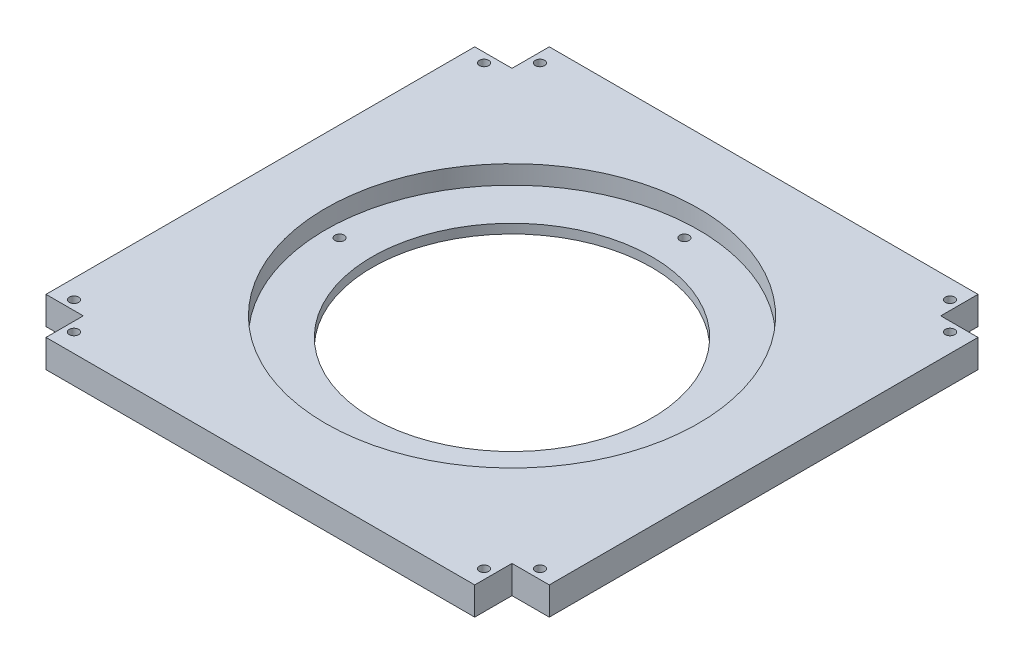
ISO-10303-21;
HEADER;
FILE_DESCRIPTION(('STEP AP214'),'2;1');
FILE_NAME('part.step','',(''),(''),'','','');
FILE_SCHEMA(('AUTOMOTIVE_DESIGN { 1 0 10303 214 1 1 1 1 }'));
ENDSEC;
DATA;
#1=APPLICATION_CONTEXT('core data for automotive mechanical design processes');
#2=APPLICATION_PROTOCOL_DEFINITION('international standard','automotive_design',2000,#1);
#3=PRODUCT_CONTEXT('',#1,'mechanical');
#4=PRODUCT('Part','Part','',(#3));
#5=PRODUCT_RELATED_PRODUCT_CATEGORY('part','',(#4));
#6=PRODUCT_DEFINITION_FORMATION('','',#4);
#7=PRODUCT_DEFINITION_CONTEXT('part definition',#1,'design');
#8=PRODUCT_DEFINITION('design','',#6,#7);
#9=PRODUCT_DEFINITION_SHAPE('','',#8);
#10=(LENGTH_UNIT() NAMED_UNIT(*) SI_UNIT(.MILLI.,.METRE.));
#11=(NAMED_UNIT(*) PLANE_ANGLE_UNIT() SI_UNIT($,.RADIAN.));
#12=(NAMED_UNIT(*) SI_UNIT($,.STERADIAN.) SOLID_ANGLE_UNIT());
#13=UNCERTAINTY_MEASURE_WITH_UNIT(LENGTH_MEASURE(1.E-05),#10,'distance_accuracy_value','');
#14=(GEOMETRIC_REPRESENTATION_CONTEXT(3) GLOBAL_UNCERTAINTY_ASSIGNED_CONTEXT((#13)) GLOBAL_UNIT_ASSIGNED_CONTEXT((#10,
#11,#12)) REPRESENTATION_CONTEXT('',''));
#15=CARTESIAN_POINT('',(0.,0.,0.));
#16=DIRECTION('',(0.,0.,1.));
#17=DIRECTION('',(1.,0.,0.));
#18=AXIS2_PLACEMENT_3D('',#15,#16,#17);
#19=CARTESIAN_POINT('',(0.,15.,0.));
#20=DIRECTION('',(1.,0.,0.));
#21=DIRECTION('',(0.,0.,-1.));
#22=AXIS2_PLACEMENT_3D('',#19,#20,#21);
#23=PLANE('',#22);
#24=DIRECTION('',(0.,0.,1.));
#25=VECTOR('',#24,1.);
#26=CARTESIAN_POINT('',(0.,0.,0.));
#27=LINE('',#26,#25);
#28=CARTESIAN_POINT('',(0.,0.,-250.));
#29=VERTEX_POINT('',#28);
#30=CARTESIAN_POINT('',(0.,0.,-20.));
#31=VERTEX_POINT('',#30);
#32=EDGE_CURVE('E158',#29,#31,#27,.T.);
#33=ORIENTED_EDGE('',*,*,#32,.T.);
#34=DIRECTION('',(0.,1.,0.));
#35=VECTOR('',#34,1.);
#36=CARTESIAN_POINT('',(0.,0.,-20.));
#37=LINE('',#36,#35);
#38=CARTESIAN_POINT('',(0.,15.,-20.));
#39=VERTEX_POINT('',#38);
#40=EDGE_CURVE('E186',#31,#39,#37,.T.);
#41=ORIENTED_EDGE('',*,*,#40,.T.);
#42=DIRECTION('',(0.,0.,1.));
#43=VECTOR('',#42,1.);
#44=CARTESIAN_POINT('',(0.,15.,0.));
#45=LINE('',#44,#43);
#46=CARTESIAN_POINT('',(0.,15.,-250.));
#47=VERTEX_POINT('',#46);
#48=EDGE_CURVE('E146',#47,#39,#45,.T.);
#49=ORIENTED_EDGE('',*,*,#48,.F.);
#50=DIRECTION('',(0.,1.,0.));
#51=VECTOR('',#50,1.);
#52=CARTESIAN_POINT('',(0.,0.,-250.));
#53=LINE('',#52,#51);
#54=EDGE_CURVE('E168',#29,#47,#53,.T.);
#55=ORIENTED_EDGE('',*,*,#54,.F.);
#56=EDGE_LOOP('',(#33,#41,#49,#55));
#57=FACE_BOUND('',#56,.T.);
#58=ADVANCED_FACE('F33',(#57),#23,.F.);
#59=CARTESIAN_POINT('',(0.,15.,0.));
#60=DIRECTION('',(0.,0.,-1.));
#61=DIRECTION('',(-1.,0.,0.));
#62=AXIS2_PLACEMENT_3D('',#59,#60,#61);
#63=PLANE('',#62);
#64=DIRECTION('',(1.,0.,0.));
#65=VECTOR('',#64,1.);
#66=CARTESIAN_POINT('',(0.,15.,0.));
#67=LINE('',#66,#65);
#68=CARTESIAN_POINT('',(20.,15.,0.));
#69=VERTEX_POINT('',#68);
#70=CARTESIAN_POINT('',(250.,15.,0.));
#71=VERTEX_POINT('',#70);
#72=EDGE_CURVE('E149',#69,#71,#67,.T.);
#73=ORIENTED_EDGE('',*,*,#72,.F.);
#74=DIRECTION('',(0.,1.,0.));
#75=VECTOR('',#74,1.);
#76=CARTESIAN_POINT('',(20.,0.,0.));
#77=LINE('',#76,#75);
#78=CARTESIAN_POINT('',(20.,0.,0.));
#79=VERTEX_POINT('',#78);
#80=EDGE_CURVE('E182',#79,#69,#77,.T.);
#81=ORIENTED_EDGE('',*,*,#80,.F.);
#82=DIRECTION('',(1.,0.,0.));
#83=VECTOR('',#82,1.);
#84=CARTESIAN_POINT('',(0.,0.,0.));
#85=LINE('',#84,#83);
#86=CARTESIAN_POINT('',(250.,0.,0.));
#87=VERTEX_POINT('',#86);
#88=EDGE_CURVE('E152',#79,#87,#85,.T.);
#89=ORIENTED_EDGE('',*,*,#88,.T.);
#90=DIRECTION('',(0.,1.,0.));
#91=VECTOR('',#90,1.);
#92=CARTESIAN_POINT('',(250.,0.,0.));
#93=LINE('',#92,#91);
#94=EDGE_CURVE('E204',#87,#71,#93,.T.);
#95=ORIENTED_EDGE('',*,*,#94,.T.);
#96=EDGE_LOOP('',(#73,#81,#89,#95));
#97=FACE_BOUND('',#96,.T.);
#98=ADVANCED_FACE('F366',(#97),#63,.F.);
#99=CARTESIAN_POINT('',(270.,15.,0.));
#100=DIRECTION('',(-1.,0.,0.));
#101=DIRECTION('',(0.,0.,1.));
#102=AXIS2_PLACEMENT_3D('',#99,#100,#101);
#103=PLANE('',#102);
#104=DIRECTION('',(0.,0.,-1.));
#105=VECTOR('',#104,1.);
#106=CARTESIAN_POINT('',(270.,15.,0.));
#107=LINE('',#106,#105);
#108=CARTESIAN_POINT('',(270.,15.,-20.));
#109=VERTEX_POINT('',#108);
#110=CARTESIAN_POINT('',(270.,15.,-250.));
#111=VERTEX_POINT('',#110);
#112=EDGE_CURVE('E41',#109,#111,#107,.T.);
#113=ORIENTED_EDGE('',*,*,#112,.F.);
#114=DIRECTION('',(0.,1.,0.));
#115=VECTOR('',#114,1.);
#116=CARTESIAN_POINT('',(270.,0.,-20.));
#117=LINE('',#116,#115);
#118=CARTESIAN_POINT('',(270.,0.,-20.));
#119=VERTEX_POINT('',#118);
#120=EDGE_CURVE('E200',#119,#109,#117,.T.);
#121=ORIENTED_EDGE('',*,*,#120,.F.);
#122=DIRECTION('',(0.,0.,-1.));
#123=VECTOR('',#122,1.);
#124=CARTESIAN_POINT('',(270.,0.,0.));
#125=LINE('',#124,#123);
#126=CARTESIAN_POINT('',(270.,0.,-250.));
#127=VERTEX_POINT('',#126);
#128=EDGE_CURVE('E147',#119,#127,#125,.T.);
#129=ORIENTED_EDGE('',*,*,#128,.T.);
#130=DIRECTION('',(0.,1.,0.));
#131=VECTOR('',#130,1.);
#132=CARTESIAN_POINT('',(270.,0.,-250.));
#133=LINE('',#132,#131);
#134=EDGE_CURVE('E179',#127,#111,#133,.T.);
#135=ORIENTED_EDGE('',*,*,#134,.T.);
#136=EDGE_LOOP('',(#113,#121,#129,#135));
#137=FACE_BOUND('',#136,.T.);
#138=ADVANCED_FACE('F373',(#137),#103,.F.);
#139=CARTESIAN_POINT('',(0.,15.,-270.));
#140=DIRECTION('',(0.,0.,1.));
#141=DIRECTION('',(1.,0.,0.));
#142=AXIS2_PLACEMENT_3D('',#139,#140,#141);
#143=PLANE('',#142);
#144=DIRECTION('',(-1.,0.,0.));
#145=VECTOR('',#144,1.);
#146=CARTESIAN_POINT('',(0.,15.,-270.));
#147=LINE('',#146,#145);
#148=CARTESIAN_POINT('',(250.,15.,-270.));
#149=VERTEX_POINT('',#148);
#150=CARTESIAN_POINT('',(20.,15.,-270.));
#151=VERTEX_POINT('',#150);
#152=EDGE_CURVE('E11',#149,#151,#147,.T.);
#153=ORIENTED_EDGE('',*,*,#152,.F.);
#154=DIRECTION('',(0.,1.,0.));
#155=VECTOR('',#154,1.);
#156=CARTESIAN_POINT('',(250.,0.,-270.));
#157=LINE('',#156,#155);
#158=CARTESIAN_POINT('',(250.,0.,-270.));
#159=VERTEX_POINT('',#158);
#160=EDGE_CURVE('E127',#159,#149,#157,.T.);
#161=ORIENTED_EDGE('',*,*,#160,.F.);
#162=DIRECTION('',(-1.,0.,0.));
#163=VECTOR('',#162,1.);
#164=CARTESIAN_POINT('',(0.,0.,-270.));
#165=LINE('',#164,#163);
#166=CARTESIAN_POINT('',(20.,0.,-270.));
#167=VERTEX_POINT('',#166);
#168=EDGE_CURVE('E36',#159,#167,#165,.T.);
#169=ORIENTED_EDGE('',*,*,#168,.T.);
#170=DIRECTION('',(0.,1.,0.));
#171=VECTOR('',#170,1.);
#172=CARTESIAN_POINT('',(20.,0.,-270.));
#173=LINE('',#172,#171);
#174=EDGE_CURVE('E162',#167,#151,#173,.T.);
#175=ORIENTED_EDGE('',*,*,#174,.T.);
#176=EDGE_LOOP('',(#153,#161,#169,#175));
#177=FACE_BOUND('',#176,.T.);
#178=ADVANCED_FACE('F139',(#177),#143,.F.);
#179=CARTESIAN_POINT('',(0.,15.,0.));
#180=DIRECTION('',(0.,-1.,0.));
#181=DIRECTION('',(0.,0.,-1.));
#182=AXIS2_PLACEMENT_3D('',#179,#180,#181);
#183=PLANE('',#182);
#184=CARTESIAN_POINT('',(135.,15.,-135.));
#185=DIRECTION('',(0.,1.,0.));
#186=DIRECTION('',(0.,0.,1.));
#187=AXIS2_PLACEMENT_3D('',#184,#185,#186);
#188=CIRCLE('',#187,100.);
#189=CARTESIAN_POINT('',(135.,15.,-35.));
#190=VERTEX_POINT('',#189);
#191=EDGE_CURVE('E269',#190,#190,#188,.T.);
#192=ORIENTED_EDGE('',*,*,#191,.F.);
#193=EDGE_LOOP('',(#192));
#194=FACE_BOUND('',#193,.T.);
#195=CARTESIAN_POINT('',(25.,15.,-260.));
#196=DIRECTION('',(0.,1.,0.));
#197=DIRECTION('',(0.,0.,1.));
#198=AXIS2_PLACEMENT_3D('',#195,#196,#197);
#199=CIRCLE('',#198,2.5);
#200=CARTESIAN_POINT('',(25.,15.,-257.5));
#201=VERTEX_POINT('',#200);
#202=EDGE_CURVE('E227',#201,#201,#199,.T.);
#203=ORIENTED_EDGE('',*,*,#202,.F.);
#204=EDGE_LOOP('',(#203));
#205=FACE_BOUND('',#204,.T.);
#206=CARTESIAN_POINT('',(245.,15.,-260.));
#207=DIRECTION('',(0.,1.,0.));
#208=DIRECTION('',(0.,0.,1.));
#209=AXIS2_PLACEMENT_3D('',#206,#207,#208);
#210=CIRCLE('',#209,2.5);
#211=CARTESIAN_POINT('',(245.,15.,-257.5));
#212=VERTEX_POINT('',#211);
#213=EDGE_CURVE('E234',#212,#212,#210,.T.);
#214=ORIENTED_EDGE('',*,*,#213,.F.);
#215=EDGE_LOOP('',(#214));
#216=FACE_BOUND('',#215,.T.);
#217=CARTESIAN_POINT('',(260.,15.,-245.));
#218=DIRECTION('',(0.,1.,0.));
#219=DIRECTION('',(0.,0.,1.));
#220=AXIS2_PLACEMENT_3D('',#217,#218,#219);
#221=CIRCLE('',#220,2.50000000000002);
#222=CARTESIAN_POINT('',(260.,15.,-242.5));
#223=VERTEX_POINT('',#222);
#224=EDGE_CURVE('E240',#223,#223,#221,.T.);
#225=ORIENTED_EDGE('',*,*,#224,.F.);
#226=EDGE_LOOP('',(#225));
#227=FACE_BOUND('',#226,.T.);
#228=CARTESIAN_POINT('',(260.,15.,-25.));
#229=DIRECTION('',(0.,1.,0.));
#230=DIRECTION('',(0.,0.,1.));
#231=AXIS2_PLACEMENT_3D('',#228,#229,#230);
#232=CIRCLE('',#231,2.50000000000002);
#233=CARTESIAN_POINT('',(260.,15.,-22.5));
#234=VERTEX_POINT('',#233);
#235=EDGE_CURVE('E246',#234,#234,#232,.T.);
#236=ORIENTED_EDGE('',*,*,#235,.F.);
#237=EDGE_LOOP('',(#236));
#238=FACE_BOUND('',#237,.T.);
#239=CARTESIAN_POINT('',(245.,15.,-10.));
#240=DIRECTION('',(0.,1.,0.));
#241=DIRECTION('',(0.,0.,1.));
#242=AXIS2_PLACEMENT_3D('',#239,#240,#241);
#243=CIRCLE('',#242,2.5);
#244=CARTESIAN_POINT('',(245.,15.,-7.5));
#245=VERTEX_POINT('',#244);
#246=EDGE_CURVE('E252',#245,#245,#243,.T.);
#247=ORIENTED_EDGE('',*,*,#246,.F.);
#248=EDGE_LOOP('',(#247));
#249=FACE_BOUND('',#248,.T.);
#250=CARTESIAN_POINT('',(25.,15.,-9.99999999999997));
#251=DIRECTION('',(0.,1.,0.));
#252=DIRECTION('',(0.,0.,1.));
#253=AXIS2_PLACEMENT_3D('',#250,#251,#252);
#254=CIRCLE('',#253,2.5);
#255=CARTESIAN_POINT('',(25.,15.,-7.49999999999997));
#256=VERTEX_POINT('',#255);
#257=EDGE_CURVE('E258',#256,#256,#254,.T.);
#258=ORIENTED_EDGE('',*,*,#257,.F.);
#259=EDGE_LOOP('',(#258));
#260=FACE_BOUND('',#259,.T.);
#261=CARTESIAN_POINT('',(10.,15.,-25.));
#262=DIRECTION('',(0.,1.,0.));
#263=DIRECTION('',(0.,0.,1.));
#264=AXIS2_PLACEMENT_3D('',#261,#262,#263);
#265=CIRCLE('',#264,2.5);
#266=CARTESIAN_POINT('',(10.,15.,-22.5));
#267=VERTEX_POINT('',#266);
#268=EDGE_CURVE('E264',#267,#267,#265,.T.);
#269=ORIENTED_EDGE('',*,*,#268,.F.);
#270=EDGE_LOOP('',(#269));
#271=FACE_BOUND('',#270,.T.);
#272=CARTESIAN_POINT('',(9.99999999999997,15.,-245.));
#273=DIRECTION('',(0.,1.,0.));
#274=DIRECTION('',(0.,0.,1.));
#275=AXIS2_PLACEMENT_3D('',#272,#273,#274);
#276=CIRCLE('',#275,2.5);
#277=CARTESIAN_POINT('',(9.99999999999997,15.,-242.5));
#278=VERTEX_POINT('',#277);
#279=EDGE_CURVE('E221',#278,#278,#276,.T.);
#280=ORIENTED_EDGE('',*,*,#279,.F.);
#281=EDGE_LOOP('',(#280));
#282=FACE_BOUND('',#281,.T.);
#283=ORIENTED_EDGE('',*,*,#48,.T.);
#284=DIRECTION('',(-1.,0.,0.));
#285=VECTOR('',#284,1.);
#286=CARTESIAN_POINT('',(0.,15.,-20.));
#287=LINE('',#286,#285);
#288=CARTESIAN_POINT('',(20.,15.,-20.));
#289=VERTEX_POINT('',#288);
#290=EDGE_CURVE('E190',#289,#39,#287,.T.);
#291=ORIENTED_EDGE('',*,*,#290,.F.);
#292=DIRECTION('',(0.,0.,-1.));
#293=VECTOR('',#292,1.);
#294=CARTESIAN_POINT('',(20.,15.,0.));
#295=LINE('',#294,#293);
#296=EDGE_CURVE('E193',#69,#289,#295,.T.);
#297=ORIENTED_EDGE('',*,*,#296,.F.);
#298=ORIENTED_EDGE('',*,*,#72,.T.);
#299=DIRECTION('',(0.,0.,1.));
#300=VECTOR('',#299,1.);
#301=CARTESIAN_POINT('',(250.,15.,0.));
#302=LINE('',#301,#300);
#303=CARTESIAN_POINT('',(250.,15.,-20.));
#304=VERTEX_POINT('',#303);
#305=EDGE_CURVE('E208',#304,#71,#302,.T.);
#306=ORIENTED_EDGE('',*,*,#305,.F.);
#307=DIRECTION('',(-1.,0.,0.));
#308=VECTOR('',#307,1.);
#309=CARTESIAN_POINT('',(270.,15.,-20.));
#310=LINE('',#309,#308);
#311=EDGE_CURVE('E189',#109,#304,#310,.T.);
#312=ORIENTED_EDGE('',*,*,#311,.F.);
#313=ORIENTED_EDGE('',*,*,#112,.T.);
#314=DIRECTION('',(1.,0.,0.));
#315=VECTOR('',#314,1.);
#316=CARTESIAN_POINT('',(270.,15.,-250.));
#317=LINE('',#316,#315);
#318=CARTESIAN_POINT('',(250.,15.,-250.));
#319=VERTEX_POINT('',#318);
#320=EDGE_CURVE('E134',#319,#111,#317,.T.);
#321=ORIENTED_EDGE('',*,*,#320,.F.);
#322=DIRECTION('',(0.,0.,1.));
#323=VECTOR('',#322,1.);
#324=CARTESIAN_POINT('',(250.,15.,-270.));
#325=LINE('',#324,#323);
#326=EDGE_CURVE('E207',#149,#319,#325,.T.);
#327=ORIENTED_EDGE('',*,*,#326,.F.);
#328=ORIENTED_EDGE('',*,*,#152,.T.);
#329=DIRECTION('',(0.,0.,-1.));
#330=VECTOR('',#329,1.);
#331=CARTESIAN_POINT('',(20.,15.,-270.));
#332=LINE('',#331,#330);
#333=CARTESIAN_POINT('',(20.,15.,-250.));
#334=VERTEX_POINT('',#333);
#335=EDGE_CURVE('E173',#334,#151,#332,.T.);
#336=ORIENTED_EDGE('',*,*,#335,.F.);
#337=DIRECTION('',(1.,0.,0.));
#338=VECTOR('',#337,1.);
#339=CARTESIAN_POINT('',(0.,15.,-250.));
#340=LINE('',#339,#338);
#341=EDGE_CURVE('E176',#47,#334,#340,.T.);
#342=ORIENTED_EDGE('',*,*,#341,.F.);
#343=EDGE_LOOP('',(#283,#291,#297,#298,#306,#312,#313,#321,#327,#328,#336,#342));
#344=FACE_BOUND('',#343,.T.);
#345=ADVANCED_FACE('F331',(#194,#205,#216,#227,#238,#249,#260,#271,#282,#344),#183,.F.);
#346=CARTESIAN_POINT('',(0.,0.,0.));
#347=DIRECTION('',(0.,-1.,0.));
#348=DIRECTION('',(0.,0.,-1.));
#349=AXIS2_PLACEMENT_3D('',#346,#347,#348);
#350=PLANE('',#349);
#351=CARTESIAN_POINT('',(135.,0.,-227.5));
#352=DIRECTION('',(0.,1.,0.));
#353=DIRECTION('',(0.,0.,1.));
#354=AXIS2_PLACEMENT_3D('',#351,#352,#353);
#355=CIRCLE('',#354,2.5);
#356=CARTESIAN_POINT('',(135.,0.,-225.));
#357=VERTEX_POINT('',#356);
#358=EDGE_CURVE('E278',#357,#357,#355,.T.);
#359=ORIENTED_EDGE('',*,*,#358,.T.);
#360=EDGE_LOOP('',(#359));
#361=FACE_BOUND('',#360,.T.);
#362=CARTESIAN_POINT('',(227.5,0.,-135.));
#363=DIRECTION('',(0.,1.,0.));
#364=DIRECTION('',(0.,0.,1.));
#365=AXIS2_PLACEMENT_3D('',#362,#363,#364);
#366=CIRCLE('',#365,2.5);
#367=CARTESIAN_POINT('',(227.5,0.,-132.5));
#368=VERTEX_POINT('',#367);
#369=EDGE_CURVE('E284',#368,#368,#366,.T.);
#370=ORIENTED_EDGE('',*,*,#369,.T.);
#371=EDGE_LOOP('',(#370));
#372=FACE_BOUND('',#371,.T.);
#373=CARTESIAN_POINT('',(135.,0.,-42.5));
#374=DIRECTION('',(0.,1.,0.));
#375=DIRECTION('',(0.,0.,1.));
#376=AXIS2_PLACEMENT_3D('',#373,#374,#375);
#377=CIRCLE('',#376,2.5);
#378=CARTESIAN_POINT('',(135.,0.,-40.));
#379=VERTEX_POINT('',#378);
#380=EDGE_CURVE('E285',#379,#379,#377,.T.);
#381=ORIENTED_EDGE('',*,*,#380,.T.);
#382=EDGE_LOOP('',(#381));
#383=FACE_BOUND('',#382,.T.);
#384=CARTESIAN_POINT('',(42.5,0.,-135.));
#385=DIRECTION('',(0.,1.,0.));
#386=DIRECTION('',(0.,0.,1.));
#387=AXIS2_PLACEMENT_3D('',#384,#385,#386);
#388=CIRCLE('',#387,2.5);
#389=CARTESIAN_POINT('',(42.5,0.,-132.5));
#390=VERTEX_POINT('',#389);
#391=EDGE_CURVE('E296',#390,#390,#388,.T.);
#392=ORIENTED_EDGE('',*,*,#391,.T.);
#393=EDGE_LOOP('',(#392));
#394=FACE_BOUND('',#393,.T.);
#395=CARTESIAN_POINT('',(135.,0.,-135.));
#396=DIRECTION('',(0.,1.,0.));
#397=DIRECTION('',(0.,0.,1.));
#398=AXIS2_PLACEMENT_3D('',#395,#396,#397);
#399=CIRCLE('',#398,75.);
#400=CARTESIAN_POINT('',(135.,0.,-60.));
#401=VERTEX_POINT('',#400);
#402=EDGE_CURVE('E272',#401,#401,#399,.T.);
#403=ORIENTED_EDGE('',*,*,#402,.T.);
#404=EDGE_LOOP('',(#403));
#405=FACE_BOUND('',#404,.T.);
#406=CARTESIAN_POINT('',(25.,0.,-260.));
#407=DIRECTION('',(0.,1.,0.));
#408=DIRECTION('',(0.,0.,1.));
#409=AXIS2_PLACEMENT_3D('',#406,#407,#408);
#410=CIRCLE('',#409,2.5);
#411=CARTESIAN_POINT('',(25.,0.,-257.5));
#412=VERTEX_POINT('',#411);
#413=EDGE_CURVE('E230',#412,#412,#410,.T.);
#414=ORIENTED_EDGE('',*,*,#413,.T.);
#415=EDGE_LOOP('',(#414));
#416=FACE_BOUND('',#415,.T.);
#417=CARTESIAN_POINT('',(245.,0.,-260.));
#418=DIRECTION('',(0.,1.,0.));
#419=DIRECTION('',(0.,0.,1.));
#420=AXIS2_PLACEMENT_3D('',#417,#418,#419);
#421=CIRCLE('',#420,2.5);
#422=CARTESIAN_POINT('',(245.,0.,-257.5));
#423=VERTEX_POINT('',#422);
#424=EDGE_CURVE('E237',#423,#423,#421,.T.);
#425=ORIENTED_EDGE('',*,*,#424,.T.);
#426=EDGE_LOOP('',(#425));
#427=FACE_BOUND('',#426,.T.);
#428=CARTESIAN_POINT('',(260.,0.,-245.));
#429=DIRECTION('',(0.,1.,0.));
#430=DIRECTION('',(0.,0.,1.));
#431=AXIS2_PLACEMENT_3D('',#428,#429,#430);
#432=CIRCLE('',#431,2.50000000000002);
#433=CARTESIAN_POINT('',(260.,0.,-242.5));
#434=VERTEX_POINT('',#433);
#435=EDGE_CURVE('E243',#434,#434,#432,.T.);
#436=ORIENTED_EDGE('',*,*,#435,.T.);
#437=EDGE_LOOP('',(#436));
#438=FACE_BOUND('',#437,.T.);
#439=CARTESIAN_POINT('',(260.,0.,-25.));
#440=DIRECTION('',(0.,1.,0.));
#441=DIRECTION('',(0.,0.,1.));
#442=AXIS2_PLACEMENT_3D('',#439,#440,#441);
#443=CIRCLE('',#442,2.50000000000002);
#444=CARTESIAN_POINT('',(260.,0.,-22.5));
#445=VERTEX_POINT('',#444);
#446=EDGE_CURVE('E249',#445,#445,#443,.T.);
#447=ORIENTED_EDGE('',*,*,#446,.T.);
#448=EDGE_LOOP('',(#447));
#449=FACE_BOUND('',#448,.T.);
#450=CARTESIAN_POINT('',(245.,0.,-10.));
#451=DIRECTION('',(0.,1.,0.));
#452=DIRECTION('',(0.,0.,1.));
#453=AXIS2_PLACEMENT_3D('',#450,#451,#452);
#454=CIRCLE('',#453,2.5);
#455=CARTESIAN_POINT('',(245.,0.,-7.5));
#456=VERTEX_POINT('',#455);
#457=EDGE_CURVE('E255',#456,#456,#454,.T.);
#458=ORIENTED_EDGE('',*,*,#457,.T.);
#459=EDGE_LOOP('',(#458));
#460=FACE_BOUND('',#459,.T.);
#461=CARTESIAN_POINT('',(25.,0.,-9.99999999999997));
#462=DIRECTION('',(0.,1.,0.));
#463=DIRECTION('',(0.,0.,1.));
#464=AXIS2_PLACEMENT_3D('',#461,#462,#463);
#465=CIRCLE('',#464,2.5);
#466=CARTESIAN_POINT('',(25.,0.,-7.49999999999997));
#467=VERTEX_POINT('',#466);
#468=EDGE_CURVE('E261',#467,#467,#465,.T.);
#469=ORIENTED_EDGE('',*,*,#468,.T.);
#470=EDGE_LOOP('',(#469));
#471=FACE_BOUND('',#470,.T.);
#472=CARTESIAN_POINT('',(10.,0.,-25.));
#473=DIRECTION('',(0.,1.,0.));
#474=DIRECTION('',(0.,0.,1.));
#475=AXIS2_PLACEMENT_3D('',#472,#473,#474);
#476=CIRCLE('',#475,2.5);
#477=CARTESIAN_POINT('',(10.,0.,-22.5));
#478=VERTEX_POINT('',#477);
#479=EDGE_CURVE('E224',#478,#478,#476,.T.);
#480=ORIENTED_EDGE('',*,*,#479,.T.);
#481=EDGE_LOOP('',(#480));
#482=FACE_BOUND('',#481,.T.);
#483=CARTESIAN_POINT('',(9.99999999999997,0.,-245.));
#484=DIRECTION('',(0.,1.,0.));
#485=DIRECTION('',(0.,0.,1.));
#486=AXIS2_PLACEMENT_3D('',#483,#484,#485);
#487=CIRCLE('',#486,2.5);
#488=CARTESIAN_POINT('',(9.99999999999997,0.,-242.5));
#489=VERTEX_POINT('',#488);
#490=EDGE_CURVE('E196',#489,#489,#487,.T.);
#491=ORIENTED_EDGE('',*,*,#490,.T.);
#492=EDGE_LOOP('',(#491));
#493=FACE_BOUND('',#492,.T.);
#494=DIRECTION('',(-1.,0.,0.));
#495=VECTOR('',#494,1.);
#496=CARTESIAN_POINT('',(0.,0.,-20.));
#497=LINE('',#496,#495);
#498=CARTESIAN_POINT('',(20.,0.,-20.));
#499=VERTEX_POINT('',#498);
#500=EDGE_CURVE('E49',#499,#31,#497,.T.);
#501=ORIENTED_EDGE('',*,*,#500,.T.);
#502=ORIENTED_EDGE('',*,*,#32,.F.);
#503=DIRECTION('',(1.,0.,0.));
#504=VECTOR('',#503,1.);
#505=CARTESIAN_POINT('',(0.,0.,-250.));
#506=LINE('',#505,#504);
#507=CARTESIAN_POINT('',(20.,0.,-250.));
#508=VERTEX_POINT('',#507);
#509=EDGE_CURVE('E175',#29,#508,#506,.T.);
#510=ORIENTED_EDGE('',*,*,#509,.T.);
#511=DIRECTION('',(0.,0.,-1.));
#512=VECTOR('',#511,1.);
#513=CARTESIAN_POINT('',(20.,0.,-270.));
#514=LINE('',#513,#512);
#515=EDGE_CURVE('E145',#508,#167,#514,.T.);
#516=ORIENTED_EDGE('',*,*,#515,.T.);
#517=ORIENTED_EDGE('',*,*,#168,.F.);
#518=DIRECTION('',(0.,0.,1.));
#519=VECTOR('',#518,1.);
#520=CARTESIAN_POINT('',(250.,0.,-270.));
#521=LINE('',#520,#519);
#522=CARTESIAN_POINT('',(250.,0.,-250.));
#523=VERTEX_POINT('',#522);
#524=EDGE_CURVE('E123',#159,#523,#521,.T.);
#525=ORIENTED_EDGE('',*,*,#524,.T.);
#526=DIRECTION('',(1.,0.,0.));
#527=VECTOR('',#526,1.);
#528=CARTESIAN_POINT('',(270.,0.,-250.));
#529=LINE('',#528,#527);
#530=EDGE_CURVE('E133',#523,#127,#529,.T.);
#531=ORIENTED_EDGE('',*,*,#530,.T.);
#532=ORIENTED_EDGE('',*,*,#128,.F.);
#533=DIRECTION('',(-1.,0.,0.));
#534=VECTOR('',#533,1.);
#535=CARTESIAN_POINT('',(270.,0.,-20.));
#536=LINE('',#535,#534);
#537=CARTESIAN_POINT('',(250.,0.,-20.));
#538=VERTEX_POINT('',#537);
#539=EDGE_CURVE('E210',#119,#538,#536,.T.);
#540=ORIENTED_EDGE('',*,*,#539,.T.);
#541=DIRECTION('',(0.,0.,1.));
#542=VECTOR('',#541,1.);
#543=CARTESIAN_POINT('',(250.,0.,0.));
#544=LINE('',#543,#542);
#545=EDGE_CURVE('E57',#538,#87,#544,.T.);
#546=ORIENTED_EDGE('',*,*,#545,.T.);
#547=ORIENTED_EDGE('',*,*,#88,.F.);
#548=DIRECTION('',(0.,0.,-1.));
#549=VECTOR('',#548,1.);
#550=CARTESIAN_POINT('',(20.,0.,0.));
#551=LINE('',#550,#549);
#552=EDGE_CURVE('E192',#79,#499,#551,.T.);
#553=ORIENTED_EDGE('',*,*,#552,.T.);
#554=EDGE_LOOP('',(#501,#502,#510,#516,#517,#525,#531,#532,#540,#546,#547,#553));
#555=FACE_BOUND('',#554,.T.);
#556=ADVANCED_FACE('F143',(#361,#372,#383,#394,#405,#416,#427,#438,#449,#460,#471,#482,#493,
#555),#350,.T.);
#557=CARTESIAN_POINT('',(20.,0.,-270.));
#558=DIRECTION('',(1.,0.,0.));
#559=DIRECTION('',(0.,0.,-1.));
#560=AXIS2_PLACEMENT_3D('',#557,#558,#559);
#561=PLANE('',#560);
#562=ORIENTED_EDGE('',*,*,#335,.T.);
#563=ORIENTED_EDGE('',*,*,#174,.F.);
#564=ORIENTED_EDGE('',*,*,#515,.F.);
#565=DIRECTION('',(0.,1.,0.));
#566=VECTOR('',#565,1.);
#567=CARTESIAN_POINT('',(20.,0.,-250.));
#568=LINE('',#567,#566);
#569=EDGE_CURVE('E170',#508,#334,#568,.T.);
#570=ORIENTED_EDGE('',*,*,#569,.T.);
#571=EDGE_LOOP('',(#562,#563,#564,#570));
#572=FACE_BOUND('',#571,.T.);
#573=ADVANCED_FACE('F378',(#572),#561,.F.);
#574=CARTESIAN_POINT('',(0.,0.,-250.));
#575=DIRECTION('',(0.,0.,1.));
#576=DIRECTION('',(1.,0.,0.));
#577=AXIS2_PLACEMENT_3D('',#574,#575,#576);
#578=PLANE('',#577);
#579=ORIENTED_EDGE('',*,*,#341,.T.);
#580=ORIENTED_EDGE('',*,*,#569,.F.);
#581=ORIENTED_EDGE('',*,*,#509,.F.);
#582=ORIENTED_EDGE('',*,*,#54,.T.);
#583=EDGE_LOOP('',(#579,#580,#581,#582));
#584=FACE_BOUND('',#583,.T.);
#585=ADVANCED_FACE('F381',(#584),#578,.F.);
#586=CARTESIAN_POINT('',(270.,0.,-250.));
#587=DIRECTION('',(0.,0.,1.));
#588=DIRECTION('',(1.,0.,0.));
#589=AXIS2_PLACEMENT_3D('',#586,#587,#588);
#590=PLANE('',#589);
#591=ORIENTED_EDGE('',*,*,#320,.T.);
#592=ORIENTED_EDGE('',*,*,#134,.F.);
#593=ORIENTED_EDGE('',*,*,#530,.F.);
#594=DIRECTION('',(0.,1.,0.));
#595=VECTOR('',#594,1.);
#596=CARTESIAN_POINT('',(250.,0.,-250.));
#597=LINE('',#596,#595);
#598=EDGE_CURVE('E129',#523,#319,#597,.T.);
#599=ORIENTED_EDGE('',*,*,#598,.T.);
#600=EDGE_LOOP('',(#591,#592,#593,#599));
#601=FACE_BOUND('',#600,.T.);
#602=ADVANCED_FACE('F375',(#601),#590,.F.);
#603=CARTESIAN_POINT('',(250.,0.,-270.));
#604=DIRECTION('',(-1.,0.,0.));
#605=DIRECTION('',(0.,0.,1.));
#606=AXIS2_PLACEMENT_3D('',#603,#604,#605);
#607=PLANE('',#606);
#608=ORIENTED_EDGE('',*,*,#326,.T.);
#609=ORIENTED_EDGE('',*,*,#598,.F.);
#610=ORIENTED_EDGE('',*,*,#524,.F.);
#611=ORIENTED_EDGE('',*,*,#160,.T.);
#612=EDGE_LOOP('',(#608,#609,#610,#611));
#613=FACE_BOUND('',#612,.T.);
#614=ADVANCED_FACE('F126',(#613),#607,.F.);
#615=CARTESIAN_POINT('',(250.,0.,0.));
#616=DIRECTION('',(-1.,0.,0.));
#617=DIRECTION('',(0.,0.,1.));
#618=AXIS2_PLACEMENT_3D('',#615,#616,#617);
#619=PLANE('',#618);
#620=ORIENTED_EDGE('',*,*,#305,.T.);
#621=ORIENTED_EDGE('',*,*,#94,.F.);
#622=ORIENTED_EDGE('',*,*,#545,.F.);
#623=DIRECTION('',(0.,1.,0.));
#624=VECTOR('',#623,1.);
#625=CARTESIAN_POINT('',(250.,0.,-20.));
#626=LINE('',#625,#624);
#627=EDGE_CURVE('E202',#538,#304,#626,.T.);
#628=ORIENTED_EDGE('',*,*,#627,.T.);
#629=EDGE_LOOP('',(#620,#621,#622,#628));
#630=FACE_BOUND('',#629,.T.);
#631=ADVANCED_FACE('F370',(#630),#619,.F.);
#632=CARTESIAN_POINT('',(270.,0.,-20.));
#633=DIRECTION('',(0.,0.,-1.));
#634=DIRECTION('',(-1.,0.,0.));
#635=AXIS2_PLACEMENT_3D('',#632,#633,#634);
#636=PLANE('',#635);
#637=ORIENTED_EDGE('',*,*,#311,.T.);
#638=ORIENTED_EDGE('',*,*,#627,.F.);
#639=ORIENTED_EDGE('',*,*,#539,.F.);
#640=ORIENTED_EDGE('',*,*,#120,.T.);
#641=EDGE_LOOP('',(#637,#638,#639,#640));
#642=FACE_BOUND('',#641,.T.);
#643=ADVANCED_FACE('F372',(#642),#636,.F.);
#644=CARTESIAN_POINT('',(0.,0.,-20.));
#645=DIRECTION('',(0.,0.,-1.));
#646=DIRECTION('',(-1.,0.,0.));
#647=AXIS2_PLACEMENT_3D('',#644,#645,#646);
#648=PLANE('',#647);
#649=ORIENTED_EDGE('',*,*,#290,.T.);
#650=ORIENTED_EDGE('',*,*,#40,.F.);
#651=ORIENTED_EDGE('',*,*,#500,.F.);
#652=DIRECTION('',(0.,1.,0.));
#653=VECTOR('',#652,1.);
#654=CARTESIAN_POINT('',(20.,0.,-20.));
#655=LINE('',#654,#653);
#656=EDGE_CURVE('E184',#499,#289,#655,.T.);
#657=ORIENTED_EDGE('',*,*,#656,.T.);
#658=EDGE_LOOP('',(#649,#650,#651,#657));
#659=FACE_BOUND('',#658,.T.);
#660=ADVANCED_FACE('F359',(#659),#648,.F.);
#661=CARTESIAN_POINT('',(20.,0.,0.));
#662=DIRECTION('',(1.,0.,0.));
#663=DIRECTION('',(0.,0.,-1.));
#664=AXIS2_PLACEMENT_3D('',#661,#662,#663);
#665=PLANE('',#664);
#666=ORIENTED_EDGE('',*,*,#296,.T.);
#667=ORIENTED_EDGE('',*,*,#656,.F.);
#668=ORIENTED_EDGE('',*,*,#552,.F.);
#669=ORIENTED_EDGE('',*,*,#80,.T.);
#670=EDGE_LOOP('',(#666,#667,#668,#669));
#671=FACE_BOUND('',#670,.T.);
#672=ADVANCED_FACE('F363',(#671),#665,.F.);
#673=CARTESIAN_POINT('',(9.99999999999997,0.,-245.));
#674=DIRECTION('',(0.,1.,0.));
#675=DIRECTION('',(0.,0.,1.));
#676=AXIS2_PLACEMENT_3D('',#673,#674,#675);
#677=CYLINDRICAL_SURFACE('',#676,2.5);
#678=ORIENTED_EDGE('',*,*,#490,.F.);
#679=EDGE_LOOP('',(#678));
#680=FACE_BOUND('',#679,.T.);
#681=ORIENTED_EDGE('',*,*,#279,.T.);
#682=EDGE_LOOP('',(#681));
#683=FACE_BOUND('',#682,.T.);
#684=ADVANCED_FACE('F432',(#680,#683),#677,.F.);
#685=CARTESIAN_POINT('',(10.,0.,-25.));
#686=DIRECTION('',(0.,1.,0.));
#687=DIRECTION('',(0.,0.,1.));
#688=AXIS2_PLACEMENT_3D('',#685,#686,#687);
#689=CYLINDRICAL_SURFACE('',#688,2.5);
#690=ORIENTED_EDGE('',*,*,#479,.F.);
#691=EDGE_LOOP('',(#690));
#692=FACE_BOUND('',#691,.T.);
#693=ORIENTED_EDGE('',*,*,#268,.T.);
#694=EDGE_LOOP('',(#693));
#695=FACE_BOUND('',#694,.T.);
#696=ADVANCED_FACE('F428',(#692,#695),#689,.F.);
#697=CARTESIAN_POINT('',(25.,0.,-9.99999999999997));
#698=DIRECTION('',(0.,1.,0.));
#699=DIRECTION('',(0.,0.,1.));
#700=AXIS2_PLACEMENT_3D('',#697,#698,#699);
#701=CYLINDRICAL_SURFACE('',#700,2.5);
#702=ORIENTED_EDGE('',*,*,#468,.F.);
#703=EDGE_LOOP('',(#702));
#704=FACE_BOUND('',#703,.T.);
#705=ORIENTED_EDGE('',*,*,#257,.T.);
#706=EDGE_LOOP('',(#705));
#707=FACE_BOUND('',#706,.T.);
#708=ADVANCED_FACE('F431',(#704,#707),#701,.F.);
#709=CARTESIAN_POINT('',(245.,0.,-10.));
#710=DIRECTION('',(0.,1.,0.));
#711=DIRECTION('',(0.,0.,1.));
#712=AXIS2_PLACEMENT_3D('',#709,#710,#711);
#713=CYLINDRICAL_SURFACE('',#712,2.5);
#714=ORIENTED_EDGE('',*,*,#457,.F.);
#715=EDGE_LOOP('',(#714));
#716=FACE_BOUND('',#715,.T.);
#717=ORIENTED_EDGE('',*,*,#246,.T.);
#718=EDGE_LOOP('',(#717));
#719=FACE_BOUND('',#718,.T.);
#720=ADVANCED_FACE('F436',(#716,#719),#713,.F.);
#721=CARTESIAN_POINT('',(260.,0.,-25.));
#722=DIRECTION('',(0.,1.,0.));
#723=DIRECTION('',(0.,0.,1.));
#724=AXIS2_PLACEMENT_3D('',#721,#722,#723);
#725=CYLINDRICAL_SURFACE('',#724,2.50000000000002);
#726=ORIENTED_EDGE('',*,*,#446,.F.);
#727=EDGE_LOOP('',(#726));
#728=FACE_BOUND('',#727,.T.);
#729=ORIENTED_EDGE('',*,*,#235,.T.);
#730=EDGE_LOOP('',(#729));
#731=FACE_BOUND('',#730,.T.);
#732=ADVANCED_FACE('F440',(#728,#731),#725,.F.);
#733=CARTESIAN_POINT('',(260.,0.,-245.));
#734=DIRECTION('',(0.,1.,0.));
#735=DIRECTION('',(0.,0.,1.));
#736=AXIS2_PLACEMENT_3D('',#733,#734,#735);
#737=CYLINDRICAL_SURFACE('',#736,2.50000000000002);
#738=ORIENTED_EDGE('',*,*,#435,.F.);
#739=EDGE_LOOP('',(#738));
#740=FACE_BOUND('',#739,.T.);
#741=ORIENTED_EDGE('',*,*,#224,.T.);
#742=EDGE_LOOP('',(#741));
#743=FACE_BOUND('',#742,.T.);
#744=ADVANCED_FACE('F444',(#740,#743),#737,.F.);
#745=CARTESIAN_POINT('',(245.,0.,-260.));
#746=DIRECTION('',(0.,1.,0.));
#747=DIRECTION('',(0.,0.,1.));
#748=AXIS2_PLACEMENT_3D('',#745,#746,#747);
#749=CYLINDRICAL_SURFACE('',#748,2.5);
#750=ORIENTED_EDGE('',*,*,#424,.F.);
#751=EDGE_LOOP('',(#750));
#752=FACE_BOUND('',#751,.T.);
#753=ORIENTED_EDGE('',*,*,#213,.T.);
#754=EDGE_LOOP('',(#753));
#755=FACE_BOUND('',#754,.T.);
#756=ADVANCED_FACE('F448',(#752,#755),#749,.F.);
#757=CARTESIAN_POINT('',(25.,0.,-260.));
#758=DIRECTION('',(0.,1.,0.));
#759=DIRECTION('',(0.,0.,1.));
#760=AXIS2_PLACEMENT_3D('',#757,#758,#759);
#761=CYLINDRICAL_SURFACE('',#760,2.5);
#762=ORIENTED_EDGE('',*,*,#413,.F.);
#763=EDGE_LOOP('',(#762));
#764=FACE_BOUND('',#763,.T.);
#765=ORIENTED_EDGE('',*,*,#202,.T.);
#766=EDGE_LOOP('',(#765));
#767=FACE_BOUND('',#766,.T.);
#768=ADVANCED_FACE('F327',(#764,#767),#761,.F.);
#769=CARTESIAN_POINT('',(135.,5.,-135.));
#770=DIRECTION('',(0.,1.,0.));
#771=DIRECTION('',(0.,0.,1.));
#772=AXIS2_PLACEMENT_3D('',#769,#770,#771);
#773=CYLINDRICAL_SURFACE('',#772,100.);
#774=CARTESIAN_POINT('',(135.,5.,-135.));
#775=DIRECTION('',(0.,1.,0.));
#776=DIRECTION('',(0.,0.,1.));
#777=AXIS2_PLACEMENT_3D('',#774,#775,#776);
#778=CIRCLE('',#777,100.);
#779=CARTESIAN_POINT('',(135.,5.,-35.));
#780=VERTEX_POINT('',#779);
#781=EDGE_CURVE('E231',#780,#780,#778,.T.);
#782=ORIENTED_EDGE('',*,*,#781,.F.);
#783=EDGE_LOOP('',(#782));
#784=FACE_BOUND('',#783,.T.);
#785=ORIENTED_EDGE('',*,*,#191,.T.);
#786=EDGE_LOOP('',(#785));
#787=FACE_BOUND('',#786,.T.);
#788=ADVANCED_FACE('F318',(#784,#787),#773,.F.);
#789=CARTESIAN_POINT('',(135.,5.,-135.));
#790=DIRECTION('',(0.,1.,0.));
#791=DIRECTION('',(0.,0.,1.));
#792=AXIS2_PLACEMENT_3D('',#789,#790,#791);
#793=PLANE('',#792);
#794=CARTESIAN_POINT('',(135.,5.,-135.));
#795=DIRECTION('',(0.,1.,0.));
#796=DIRECTION('',(0.,0.,1.));
#797=AXIS2_PLACEMENT_3D('',#794,#795,#796);
#798=CIRCLE('',#797,75.);
#799=CARTESIAN_POINT('',(135.,5.,-60.));
#800=VERTEX_POINT('',#799);
#801=EDGE_CURVE('E275',#800,#800,#798,.T.);
#802=ORIENTED_EDGE('',*,*,#801,.F.);
#803=EDGE_LOOP('',(#802));
#804=FACE_BOUND('',#803,.T.);
#805=CARTESIAN_POINT('',(135.,5.,-227.5));
#806=DIRECTION('',(0.,1.,0.));
#807=DIRECTION('',(0.,0.,1.));
#808=AXIS2_PLACEMENT_3D('',#805,#806,#807);
#809=CIRCLE('',#808,2.5);
#810=CARTESIAN_POINT('',(135.,5.,-225.));
#811=VERTEX_POINT('',#810);
#812=EDGE_CURVE('E288',#811,#811,#809,.T.);
#813=ORIENTED_EDGE('',*,*,#812,.F.);
#814=EDGE_LOOP('',(#813));
#815=FACE_BOUND('',#814,.T.);
#816=CARTESIAN_POINT('',(227.5,5.,-135.));
#817=DIRECTION('',(0.,1.,0.));
#818=DIRECTION('',(0.,0.,1.));
#819=AXIS2_PLACEMENT_3D('',#816,#817,#818);
#820=CIRCLE('',#819,2.5);
#821=CARTESIAN_POINT('',(227.5,5.,-132.5));
#822=VERTEX_POINT('',#821);
#823=EDGE_CURVE('E281',#822,#822,#820,.T.);
#824=ORIENTED_EDGE('',*,*,#823,.F.);
#825=EDGE_LOOP('',(#824));
#826=FACE_BOUND('',#825,.T.);
#827=CARTESIAN_POINT('',(135.,5.,-42.5));
#828=DIRECTION('',(0.,1.,0.));
#829=DIRECTION('',(0.,0.,1.));
#830=AXIS2_PLACEMENT_3D('',#827,#828,#829);
#831=CIRCLE('',#830,2.5);
#832=CARTESIAN_POINT('',(135.,5.,-40.));
#833=VERTEX_POINT('',#832);
#834=EDGE_CURVE('E299',#833,#833,#831,.T.);
#835=ORIENTED_EDGE('',*,*,#834,.F.);
#836=EDGE_LOOP('',(#835));
#837=FACE_BOUND('',#836,.T.);
#838=CARTESIAN_POINT('',(42.5,5.,-135.));
#839=DIRECTION('',(0.,1.,0.));
#840=DIRECTION('',(0.,0.,1.));
#841=AXIS2_PLACEMENT_3D('',#838,#839,#840);
#842=CIRCLE('',#841,2.5);
#843=CARTESIAN_POINT('',(42.5,5.,-132.5));
#844=VERTEX_POINT('',#843);
#845=EDGE_CURVE('E293',#844,#844,#842,.T.);
#846=ORIENTED_EDGE('',*,*,#845,.F.);
#847=EDGE_LOOP('',(#846));
#848=FACE_BOUND('',#847,.T.);
#849=ORIENTED_EDGE('',*,*,#781,.T.);
#850=EDGE_LOOP('',(#849));
#851=FACE_BOUND('',#850,.T.);
#852=ADVANCED_FACE('F315',(#804,#815,#826,#837,#848,#851),#793,.T.);
#853=CARTESIAN_POINT('',(42.5,0.,-135.));
#854=DIRECTION('',(0.,1.,0.));
#855=DIRECTION('',(0.,0.,1.));
#856=AXIS2_PLACEMENT_3D('',#853,#854,#855);
#857=CYLINDRICAL_SURFACE('',#856,2.5);
#858=ORIENTED_EDGE('',*,*,#391,.F.);
#859=EDGE_LOOP('',(#858));
#860=FACE_BOUND('',#859,.T.);
#861=ORIENTED_EDGE('',*,*,#845,.T.);
#862=EDGE_LOOP('',(#861));
#863=FACE_BOUND('',#862,.T.);
#864=ADVANCED_FACE('F311',(#860,#863),#857,.F.);
#865=CARTESIAN_POINT('',(135.,0.,-42.5));
#866=DIRECTION('',(0.,1.,0.));
#867=DIRECTION('',(0.,0.,1.));
#868=AXIS2_PLACEMENT_3D('',#865,#866,#867);
#869=CYLINDRICAL_SURFACE('',#868,2.5);
#870=ORIENTED_EDGE('',*,*,#380,.F.);
#871=EDGE_LOOP('',(#870));
#872=FACE_BOUND('',#871,.T.);
#873=ORIENTED_EDGE('',*,*,#834,.T.);
#874=EDGE_LOOP('',(#873));
#875=FACE_BOUND('',#874,.T.);
#876=ADVANCED_FACE('F307',(#872,#875),#869,.F.);
#877=CARTESIAN_POINT('',(227.5,0.,-135.));
#878=DIRECTION('',(0.,1.,0.));
#879=DIRECTION('',(0.,0.,1.));
#880=AXIS2_PLACEMENT_3D('',#877,#878,#879);
#881=CYLINDRICAL_SURFACE('',#880,2.5);
#882=ORIENTED_EDGE('',*,*,#369,.F.);
#883=EDGE_LOOP('',(#882));
#884=FACE_BOUND('',#883,.T.);
#885=ORIENTED_EDGE('',*,*,#823,.T.);
#886=EDGE_LOOP('',(#885));
#887=FACE_BOUND('',#886,.T.);
#888=ADVANCED_FACE('F310',(#884,#887),#881,.F.);
#889=CARTESIAN_POINT('',(135.,0.,-227.5));
#890=DIRECTION('',(0.,1.,0.));
#891=DIRECTION('',(0.,0.,1.));
#892=AXIS2_PLACEMENT_3D('',#889,#890,#891);
#893=CYLINDRICAL_SURFACE('',#892,2.5);
#894=ORIENTED_EDGE('',*,*,#358,.F.);
#895=EDGE_LOOP('',(#894));
#896=FACE_BOUND('',#895,.T.);
#897=ORIENTED_EDGE('',*,*,#812,.T.);
#898=EDGE_LOOP('',(#897));
#899=FACE_BOUND('',#898,.T.);
#900=ADVANCED_FACE('F413',(#896,#899),#893,.F.);
#901=CARTESIAN_POINT('',(135.,0.,-135.));
#902=DIRECTION('',(0.,1.,0.));
#903=DIRECTION('',(0.,0.,1.));
#904=AXIS2_PLACEMENT_3D('',#901,#902,#903);
#905=CYLINDRICAL_SURFACE('',#904,75.);
#906=ORIENTED_EDGE('',*,*,#402,.F.);
#907=EDGE_LOOP('',(#906));
#908=FACE_BOUND('',#907,.T.);
#909=ORIENTED_EDGE('',*,*,#801,.T.);
#910=EDGE_LOOP('',(#909));
#911=FACE_BOUND('',#910,.T.);
#912=ADVANCED_FACE('F420',(#908,#911),#905,.F.);
#913=CLOSED_SHELL('',(#58,#98,#138,#178,#345,#556,#573,#585,#602,#614,#631,#643,#660,#672,#684,
#696,#708,#720,#732,#744,#756,#768,#788,#852,#864,#876,#888,#900,#912));
#914=MANIFOLD_SOLID_BREP('B2',#913);
#915=ADVANCED_BREP_SHAPE_REPRESENTATION('',(#18,#914),#14);
#916=SHAPE_DEFINITION_REPRESENTATION(#9,#915);
ENDSEC;
END-ISO-10303-21;
